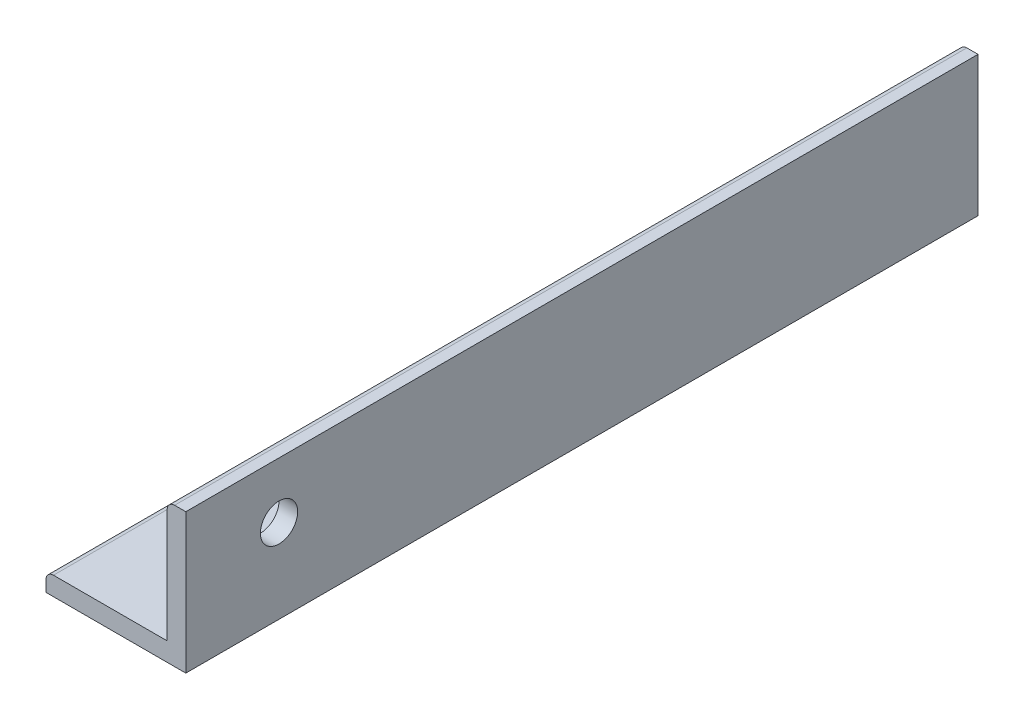
ISO-10303-21;
HEADER;
FILE_DESCRIPTION(('STEP AP214'),'2;1');
FILE_NAME('part.step','',(''),(''),'','','');
FILE_SCHEMA(('AUTOMOTIVE_DESIGN { 1 0 10303 214 1 1 1 1 }'));
ENDSEC;
DATA;
#1=APPLICATION_CONTEXT('core data for automotive mechanical design processes');
#2=APPLICATION_PROTOCOL_DEFINITION('international standard','automotive_design',2000,#1);
#3=PRODUCT_CONTEXT('',#1,'mechanical');
#4=PRODUCT('Part','Part','',(#3));
#5=PRODUCT_RELATED_PRODUCT_CATEGORY('part','',(#4));
#6=PRODUCT_DEFINITION_FORMATION('','',#4);
#7=PRODUCT_DEFINITION_CONTEXT('part definition',#1,'design');
#8=PRODUCT_DEFINITION('design','',#6,#7);
#9=PRODUCT_DEFINITION_SHAPE('','',#8);
#10=(LENGTH_UNIT() NAMED_UNIT(*) SI_UNIT(.MILLI.,.METRE.));
#11=(NAMED_UNIT(*) PLANE_ANGLE_UNIT() SI_UNIT($,.RADIAN.));
#12=(NAMED_UNIT(*) SI_UNIT($,.STERADIAN.) SOLID_ANGLE_UNIT());
#13=UNCERTAINTY_MEASURE_WITH_UNIT(LENGTH_MEASURE(1.E-05),#10,'distance_accuracy_value','');
#14=(GEOMETRIC_REPRESENTATION_CONTEXT(3) GLOBAL_UNCERTAINTY_ASSIGNED_CONTEXT((#13)) GLOBAL_UNIT_ASSIGNED_CONTEXT((#10,
#11,#12)) REPRESENTATION_CONTEXT('',''));
#15=CARTESIAN_POINT('',(0.,0.,0.));
#16=DIRECTION('',(0.,0.,1.));
#17=DIRECTION('',(1.,0.,0.));
#18=AXIS2_PLACEMENT_3D('',#15,#16,#17);
#19=CARTESIAN_POINT('',(0.,0.,85.));
#20=DIRECTION('',(0.,1.,0.));
#21=DIRECTION('',(-1.,0.,0.));
#22=AXIS2_PLACEMENT_3D('',#19,#20,#21);
#23=PLANE('',#22);
#24=CARTESIAN_POINT('',(-8.,0.,15.));
#25=DIRECTION('',(0.,1.,0.));
#26=DIRECTION('',(-1.,0.,0.));
#27=AXIS2_PLACEMENT_3D('',#24,#25,#26);
#28=CIRCLE('',#27,2.);
#29=CARTESIAN_POINT('',(-10.,0.,15.));
#30=VERTEX_POINT('',#29);
#31=EDGE_CURVE('E176',#30,#30,#28,.T.);
#32=ORIENTED_EDGE('',*,*,#31,.T.);
#33=EDGE_LOOP('',(#32));
#34=FACE_BOUND('',#33,.T.);
#35=DIRECTION('',(1.,0.,0.));
#36=VECTOR('',#35,1.);
#37=CARTESIAN_POINT('',(0.,0.,0.));
#38=LINE('',#37,#36);
#39=CARTESIAN_POINT('',(-15.,0.,0.));
#40=VERTEX_POINT('',#39);
#41=CARTESIAN_POINT('',(0.,0.,0.));
#42=VERTEX_POINT('',#41);
#43=EDGE_CURVE('E122',#40,#42,#38,.T.);
#44=ORIENTED_EDGE('',*,*,#43,.T.);
#45=DIRECTION('',(0.,0.,-1.));
#46=VECTOR('',#45,1.);
#47=CARTESIAN_POINT('',(0.,0.,85.));
#48=LINE('',#47,#46);
#49=CARTESIAN_POINT('',(0.,0.,85.));
#50=VERTEX_POINT('',#49);
#51=EDGE_CURVE('E104',#50,#42,#48,.T.);
#52=ORIENTED_EDGE('',*,*,#51,.F.);
#53=DIRECTION('',(1.,0.,0.));
#54=VECTOR('',#53,1.);
#55=CARTESIAN_POINT('',(0.,0.,85.));
#56=LINE('',#55,#54);
#57=CARTESIAN_POINT('',(-15.,0.,85.));
#58=VERTEX_POINT('',#57);
#59=EDGE_CURVE('E109',#58,#50,#56,.T.);
#60=ORIENTED_EDGE('',*,*,#59,.F.);
#61=DIRECTION('',(0.,0.,-1.));
#62=VECTOR('',#61,1.);
#63=CARTESIAN_POINT('',(-15.,0.,85.));
#64=LINE('',#63,#62);
#65=EDGE_CURVE('E164',#58,#40,#64,.T.);
#66=ORIENTED_EDGE('',*,*,#65,.T.);
#67=EDGE_LOOP('',(#44,#52,#60,#66));
#68=FACE_BOUND('',#67,.T.);
#69=ADVANCED_FACE('F35',(#34,#68),#23,.F.);
#70=CARTESIAN_POINT('',(0.,0.,85.));
#71=DIRECTION('',(-1.,0.,0.));
#72=DIRECTION('',(0.,0.,1.));
#73=AXIS2_PLACEMENT_3D('',#70,#71,#72);
#74=PLANE('',#73);
#75=CARTESIAN_POINT('',(0.,9.,75.));
#76=DIRECTION('',(-1.,0.,0.));
#77=DIRECTION('',(0.,0.,1.));
#78=AXIS2_PLACEMENT_3D('',#75,#76,#77);
#79=CIRCLE('',#78,2.);
#80=CARTESIAN_POINT('',(0.,9.,77.));
#81=VERTEX_POINT('',#80);
#82=EDGE_CURVE('E182',#81,#81,#79,.T.);
#83=ORIENTED_EDGE('',*,*,#82,.T.);
#84=EDGE_LOOP('',(#83));
#85=FACE_BOUND('',#84,.T.);
#86=DIRECTION('',(0.,1.,0.));
#87=VECTOR('',#86,1.);
#88=CARTESIAN_POINT('',(0.,0.,0.));
#89=LINE('',#88,#87);
#90=CARTESIAN_POINT('',(0.,15.,0.));
#91=VERTEX_POINT('',#90);
#92=EDGE_CURVE('E159',#42,#91,#89,.T.);
#93=ORIENTED_EDGE('',*,*,#92,.T.);
#94=DIRECTION('',(0.,0.,-1.));
#95=VECTOR('',#94,1.);
#96=CARTESIAN_POINT('',(0.,15.,85.));
#97=LINE('',#96,#95);
#98=CARTESIAN_POINT('',(0.,15.,85.));
#99=VERTEX_POINT('',#98);
#100=EDGE_CURVE('E107',#99,#91,#97,.T.);
#101=ORIENTED_EDGE('',*,*,#100,.F.);
#102=DIRECTION('',(0.,1.,0.));
#103=VECTOR('',#102,1.);
#104=CARTESIAN_POINT('',(0.,0.,85.));
#105=LINE('',#104,#103);
#106=EDGE_CURVE('E100',#50,#99,#105,.T.);
#107=ORIENTED_EDGE('',*,*,#106,.F.);
#108=ORIENTED_EDGE('',*,*,#51,.T.);
#109=EDGE_LOOP('',(#93,#101,#107,#108));
#110=FACE_BOUND('',#109,.T.);
#111=ADVANCED_FACE('F102',(#85,#110),#74,.F.);
#112=CARTESIAN_POINT('',(0.,15.,85.));
#113=DIRECTION('',(0.,-1.,0.));
#114=DIRECTION('',(0.,0.,-1.));
#115=AXIS2_PLACEMENT_3D('',#112,#113,#114);
#116=PLANE('',#115);
#117=DIRECTION('',(-1.,0.,0.));
#118=VECTOR('',#117,1.);
#119=CARTESIAN_POINT('',(0.,15.,0.));
#120=LINE('',#119,#118);
#121=CARTESIAN_POINT('',(-1.2,15.,0.));
#122=VERTEX_POINT('',#121);
#123=EDGE_CURVE('E156',#91,#122,#120,.T.);
#124=ORIENTED_EDGE('',*,*,#123,.T.);
#125=DIRECTION('',(0.,0.,-1.));
#126=VECTOR('',#125,1.);
#127=CARTESIAN_POINT('',(-1.2,15.,85.));
#128=LINE('',#127,#126);
#129=CARTESIAN_POINT('',(-1.2,15.,85.));
#130=VERTEX_POINT('',#129);
#131=EDGE_CURVE('E11',#122,#130,#128,.F.);
#132=ORIENTED_EDGE('',*,*,#131,.T.);
#133=DIRECTION('',(-1.,0.,0.));
#134=VECTOR('',#133,1.);
#135=CARTESIAN_POINT('',(0.,15.,85.));
#136=LINE('',#135,#134);
#137=EDGE_CURVE('E108',#99,#130,#136,.T.);
#138=ORIENTED_EDGE('',*,*,#137,.F.);
#139=ORIENTED_EDGE('',*,*,#100,.T.);
#140=EDGE_LOOP('',(#124,#132,#138,#139));
#141=FACE_BOUND('',#140,.T.);
#142=ADVANCED_FACE('F177',(#141),#116,.F.);
#143=CARTESIAN_POINT('',(-2.,15.,85.));
#144=DIRECTION('',(1.,0.,0.));
#145=DIRECTION('',(0.,1.,0.));
#146=AXIS2_PLACEMENT_3D('',#143,#144,#145);
#147=PLANE('',#146);
#148=CARTESIAN_POINT('',(-2.,9.,75.));
#149=DIRECTION('',(-1.,0.,0.));
#150=DIRECTION('',(0.,-1.,0.));
#151=AXIS2_PLACEMENT_3D('',#148,#149,#150);
#152=CIRCLE('',#151,2.);
#153=CARTESIAN_POINT('',(-2.,7.,75.));
#154=VERTEX_POINT('',#153);
#155=EDGE_CURVE('E187',#154,#154,#152,.T.);
#156=ORIENTED_EDGE('',*,*,#155,.F.);
#157=EDGE_LOOP('',(#156));
#158=FACE_BOUND('',#157,.T.);
#159=DIRECTION('',(0.,-1.,0.));
#160=VECTOR('',#159,1.);
#161=CARTESIAN_POINT('',(-2.,15.,85.));
#162=LINE('',#161,#160);
#163=CARTESIAN_POINT('',(-2.,14.2,85.));
#164=VERTEX_POINT('',#163);
#165=CARTESIAN_POINT('',(-2.,2.,85.));
#166=VERTEX_POINT('',#165);
#167=EDGE_CURVE('E147',#164,#166,#162,.T.);
#168=ORIENTED_EDGE('',*,*,#167,.F.);
#169=DIRECTION('',(0.,0.,-1.));
#170=VECTOR('',#169,1.);
#171=CARTESIAN_POINT('',(-2.,14.2,85.));
#172=LINE('',#171,#170);
#173=CARTESIAN_POINT('',(-2.,14.2,0.));
#174=VERTEX_POINT('',#173);
#175=EDGE_CURVE('E43',#164,#174,#172,.T.);
#176=ORIENTED_EDGE('',*,*,#175,.T.);
#177=DIRECTION('',(0.,-1.,0.));
#178=VECTOR('',#177,1.);
#179=CARTESIAN_POINT('',(-2.,15.,0.));
#180=LINE('',#179,#178);
#181=CARTESIAN_POINT('',(-2.,2.,0.));
#182=VERTEX_POINT('',#181);
#183=EDGE_CURVE('E145',#174,#182,#180,.T.);
#184=ORIENTED_EDGE('',*,*,#183,.T.);
#185=DIRECTION('',(0.,0.,-1.));
#186=VECTOR('',#185,1.);
#187=CARTESIAN_POINT('',(-2.,2.,85.));
#188=LINE('',#187,#186);
#189=EDGE_CURVE('E128',#166,#182,#188,.T.);
#190=ORIENTED_EDGE('',*,*,#189,.F.);
#191=EDGE_LOOP('',(#168,#176,#184,#190));
#192=FACE_BOUND('',#191,.T.);
#193=ADVANCED_FACE('F143',(#158,#192),#147,.F.);
#194=CARTESIAN_POINT('',(-15.,2.,85.));
#195=DIRECTION('',(0.,-1.,0.));
#196=DIRECTION('',(0.,0.,-1.));
#197=AXIS2_PLACEMENT_3D('',#194,#195,#196);
#198=PLANE('',#197);
#199=CARTESIAN_POINT('',(-8.,2.,15.));
#200=DIRECTION('',(0.,1.,0.));
#201=DIRECTION('',(-1.,0.,0.));
#202=AXIS2_PLACEMENT_3D('',#199,#200,#201);
#203=CIRCLE('',#202,2.);
#204=CARTESIAN_POINT('',(-10.,2.,15.));
#205=VERTEX_POINT('',#204);
#206=EDGE_CURVE('E179',#205,#205,#203,.T.);
#207=ORIENTED_EDGE('',*,*,#206,.F.);
#208=EDGE_LOOP('',(#207));
#209=FACE_BOUND('',#208,.T.);
#210=DIRECTION('',(-1.,0.,0.));
#211=VECTOR('',#210,1.);
#212=CARTESIAN_POINT('',(-15.,2.,0.));
#213=LINE('',#212,#211);
#214=CARTESIAN_POINT('',(-14.2,2.,0.));
#215=VERTEX_POINT('',#214);
#216=EDGE_CURVE('E155',#182,#215,#213,.T.);
#217=ORIENTED_EDGE('',*,*,#216,.T.);
#218=DIRECTION('',(0.,0.,-1.));
#219=VECTOR('',#218,1.);
#220=CARTESIAN_POINT('',(-14.2,2.,85.));
#221=LINE('',#220,#219);
#222=CARTESIAN_POINT('',(-14.2,2.,85.));
#223=VERTEX_POINT('',#222);
#224=EDGE_CURVE('E135',#215,#223,#221,.F.);
#225=ORIENTED_EDGE('',*,*,#224,.T.);
#226=DIRECTION('',(-1.,0.,0.));
#227=VECTOR('',#226,1.);
#228=CARTESIAN_POINT('',(-15.,2.,85.));
#229=LINE('',#228,#227);
#230=EDGE_CURVE('E169',#166,#223,#229,.T.);
#231=ORIENTED_EDGE('',*,*,#230,.F.);
#232=ORIENTED_EDGE('',*,*,#189,.T.);
#233=EDGE_LOOP('',(#217,#225,#231,#232));
#234=FACE_BOUND('',#233,.T.);
#235=ADVANCED_FACE('F167',(#209,#234),#198,.F.);
#236=CARTESIAN_POINT('',(-15.,0.,85.));
#237=DIRECTION('',(1.,0.,0.));
#238=DIRECTION('',(0.,0.,-1.));
#239=AXIS2_PLACEMENT_3D('',#236,#237,#238);
#240=PLANE('',#239);
#241=DIRECTION('',(0.,-1.,0.));
#242=VECTOR('',#241,1.);
#243=CARTESIAN_POINT('',(-15.,0.,85.));
#244=LINE('',#243,#242);
#245=CARTESIAN_POINT('',(-15.,1.2,85.));
#246=VERTEX_POINT('',#245);
#247=EDGE_CURVE('E115',#246,#58,#244,.T.);
#248=ORIENTED_EDGE('',*,*,#247,.F.);
#249=DIRECTION('',(0.,0.,-1.));
#250=VECTOR('',#249,1.);
#251=CARTESIAN_POINT('',(-15.,1.2,85.));
#252=LINE('',#251,#250);
#253=CARTESIAN_POINT('',(-15.,1.2,0.));
#254=VERTEX_POINT('',#253);
#255=EDGE_CURVE('E123',#246,#254,#252,.T.);
#256=ORIENTED_EDGE('',*,*,#255,.T.);
#257=DIRECTION('',(0.,-1.,0.));
#258=VECTOR('',#257,1.);
#259=CARTESIAN_POINT('',(-15.,0.,0.));
#260=LINE('',#259,#258);
#261=EDGE_CURVE('E119',#254,#40,#260,.T.);
#262=ORIENTED_EDGE('',*,*,#261,.T.);
#263=ORIENTED_EDGE('',*,*,#65,.F.);
#264=EDGE_LOOP('',(#248,#256,#262,#263));
#265=FACE_BOUND('',#264,.T.);
#266=ADVANCED_FACE('F200',(#265),#240,.F.);
#267=CARTESIAN_POINT('',(0.,0.,85.));
#268=DIRECTION('',(0.,0.,-1.));
#269=DIRECTION('',(-1.,0.,0.));
#270=AXIS2_PLACEMENT_3D('',#267,#268,#269);
#271=PLANE('',#270);
#272=ORIENTED_EDGE('',*,*,#230,.T.);
#273=CARTESIAN_POINT('',(-14.2,1.2,85.));
#274=DIRECTION('',(0.,0.,-1.));
#275=DIRECTION('',(-1.,0.,0.));
#276=AXIS2_PLACEMENT_3D('',#273,#274,#275);
#277=CIRCLE('',#276,0.8);
#278=EDGE_CURVE('E138',#223,#246,#277,.F.);
#279=ORIENTED_EDGE('',*,*,#278,.T.);
#280=ORIENTED_EDGE('',*,*,#247,.T.);
#281=ORIENTED_EDGE('',*,*,#59,.T.);
#282=ORIENTED_EDGE('',*,*,#106,.T.);
#283=ORIENTED_EDGE('',*,*,#137,.T.);
#284=CARTESIAN_POINT('',(-1.2,14.2,85.));
#285=DIRECTION('',(0.,0.,-1.));
#286=DIRECTION('',(-1.,0.,0.));
#287=AXIS2_PLACEMENT_3D('',#284,#285,#286);
#288=CIRCLE('',#287,0.8);
#289=EDGE_CURVE('E50',#130,#164,#288,.F.);
#290=ORIENTED_EDGE('',*,*,#289,.T.);
#291=ORIENTED_EDGE('',*,*,#167,.T.);
#292=EDGE_LOOP('',(#272,#279,#280,#281,#282,#283,#290,#291));
#293=FACE_BOUND('',#292,.T.);
#294=ADVANCED_FACE('F113',(#293),#271,.F.);
#295=CARTESIAN_POINT('',(0.,0.,0.));
#296=DIRECTION('',(0.,0.,-1.));
#297=DIRECTION('',(-1.,0.,0.));
#298=AXIS2_PLACEMENT_3D('',#295,#296,#297);
#299=PLANE('',#298);
#300=ORIENTED_EDGE('',*,*,#261,.F.);
#301=CARTESIAN_POINT('',(-14.2,1.2,0.));
#302=DIRECTION('',(0.,0.,-1.));
#303=DIRECTION('',(-1.,0.,0.));
#304=AXIS2_PLACEMENT_3D('',#301,#302,#303);
#305=CIRCLE('',#304,0.8);
#306=EDGE_CURVE('E133',#254,#215,#305,.T.);
#307=ORIENTED_EDGE('',*,*,#306,.T.);
#308=ORIENTED_EDGE('',*,*,#216,.F.);
#309=ORIENTED_EDGE('',*,*,#183,.F.);
#310=CARTESIAN_POINT('',(-1.2,14.2,0.));
#311=DIRECTION('',(0.,0.,-1.));
#312=DIRECTION('',(-1.,0.,0.));
#313=AXIS2_PLACEMENT_3D('',#310,#311,#312);
#314=CIRCLE('',#313,0.8);
#315=EDGE_CURVE('E126',#174,#122,#314,.T.);
#316=ORIENTED_EDGE('',*,*,#315,.T.);
#317=ORIENTED_EDGE('',*,*,#123,.F.);
#318=ORIENTED_EDGE('',*,*,#92,.F.);
#319=ORIENTED_EDGE('',*,*,#43,.F.);
#320=EDGE_LOOP('',(#300,#307,#308,#309,#316,#317,#318,#319));
#321=FACE_BOUND('',#320,.T.);
#322=ADVANCED_FACE('F152',(#321),#299,.T.);
#323=CARTESIAN_POINT('',(-14.2,1.2,85.));
#324=DIRECTION('',(0.,0.,-1.));
#325=DIRECTION('',(-1.,0.,0.));
#326=AXIS2_PLACEMENT_3D('',#323,#324,#325);
#327=CYLINDRICAL_SURFACE('',#326,0.8);
#328=ORIENTED_EDGE('',*,*,#278,.F.);
#329=ORIENTED_EDGE('',*,*,#224,.F.);
#330=ORIENTED_EDGE('',*,*,#306,.F.);
#331=ORIENTED_EDGE('',*,*,#255,.F.);
#332=EDGE_LOOP('',(#328,#329,#330,#331));
#333=FACE_BOUND('',#332,.T.);
#334=ADVANCED_FACE('F212',(#333),#327,.T.);
#335=CARTESIAN_POINT('',(-1.2,14.2,85.));
#336=DIRECTION('',(0.,0.,-1.));
#337=DIRECTION('',(-1.,0.,0.));
#338=AXIS2_PLACEMENT_3D('',#335,#336,#337);
#339=CYLINDRICAL_SURFACE('',#338,0.8);
#340=ORIENTED_EDGE('',*,*,#289,.F.);
#341=ORIENTED_EDGE('',*,*,#131,.F.);
#342=ORIENTED_EDGE('',*,*,#315,.F.);
#343=ORIENTED_EDGE('',*,*,#175,.F.);
#344=EDGE_LOOP('',(#340,#341,#342,#343));
#345=FACE_BOUND('',#344,.T.);
#346=ADVANCED_FACE('F37',(#345),#339,.T.);
#347=CARTESIAN_POINT('',(-8.,0.,15.));
#348=DIRECTION('',(0.,1.,0.));
#349=DIRECTION('',(-1.,0.,0.));
#350=AXIS2_PLACEMENT_3D('',#347,#348,#349);
#351=CYLINDRICAL_SURFACE('',#350,2.);
#352=ORIENTED_EDGE('',*,*,#31,.F.);
#353=EDGE_LOOP('',(#352));
#354=FACE_BOUND('',#353,.T.);
#355=ORIENTED_EDGE('',*,*,#206,.T.);
#356=EDGE_LOOP('',(#355));
#357=FACE_BOUND('',#356,.T.);
#358=ADVANCED_FACE('F219',(#354,#357),#351,.F.);
#359=CARTESIAN_POINT('',(398.,9.00000000000002,75.));
#360=DIRECTION('',(-1.,0.,0.));
#361=DIRECTION('',(0.,-1.,0.));
#362=AXIS2_PLACEMENT_3D('',#359,#360,#361);
#363=CYLINDRICAL_SURFACE('',#362,2.);
#364=ORIENTED_EDGE('',*,*,#155,.T.);
#365=EDGE_LOOP('',(#364));
#366=FACE_BOUND('',#365,.T.);
#367=ORIENTED_EDGE('',*,*,#82,.F.);
#368=EDGE_LOOP('',(#367));
#369=FACE_BOUND('',#368,.T.);
#370=ADVANCED_FACE('F191',(#366,#369),#363,.F.);
#371=CLOSED_SHELL('',(#69,#111,#142,#193,#235,#266,#294,#322,#334,#346,#358,#370));
#372=MANIFOLD_SOLID_BREP('B2',#371);
#373=ADVANCED_BREP_SHAPE_REPRESENTATION('',(#18,#372),#14);
#374=SHAPE_DEFINITION_REPRESENTATION(#9,#373);
ENDSEC;
END-ISO-10303-21;
